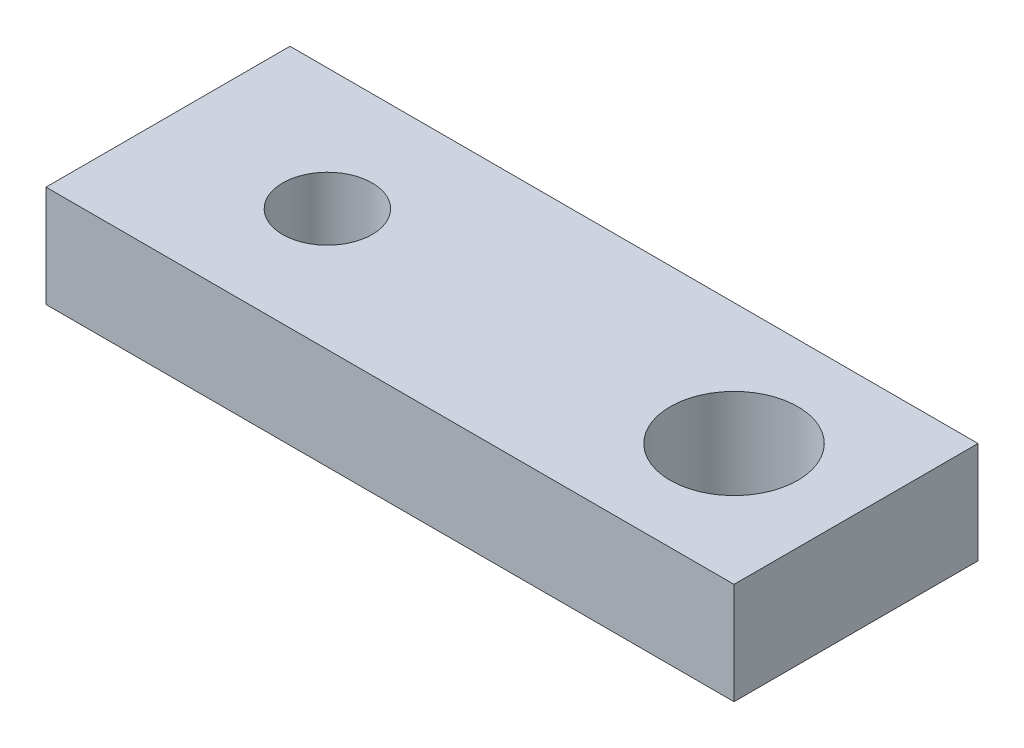
ISO-10303-21;
HEADER;
FILE_DESCRIPTION(('STEP AP214'),'2;1');
FILE_NAME('part.step','',(''),(''),'','','');
FILE_SCHEMA(('AUTOMOTIVE_DESIGN { 1 0 10303 214 1 1 1 1 }'));
ENDSEC;
DATA;
#1=APPLICATION_CONTEXT('core data for automotive mechanical design processes');
#2=APPLICATION_PROTOCOL_DEFINITION('international standard','automotive_design',2000,#1);
#3=PRODUCT_CONTEXT('',#1,'mechanical');
#4=PRODUCT('Part','Part','',(#3));
#5=PRODUCT_RELATED_PRODUCT_CATEGORY('part','',(#4));
#6=PRODUCT_DEFINITION_FORMATION('','',#4);
#7=PRODUCT_DEFINITION_CONTEXT('part definition',#1,'design');
#8=PRODUCT_DEFINITION('design','',#6,#7);
#9=PRODUCT_DEFINITION_SHAPE('','',#8);
#10=(LENGTH_UNIT() NAMED_UNIT(*) SI_UNIT(.MILLI.,.METRE.));
#11=(NAMED_UNIT(*) PLANE_ANGLE_UNIT() SI_UNIT($,.RADIAN.));
#12=(NAMED_UNIT(*) SI_UNIT($,.STERADIAN.) SOLID_ANGLE_UNIT());
#13=UNCERTAINTY_MEASURE_WITH_UNIT(LENGTH_MEASURE(1.E-05),#10,'distance_accuracy_value','');
#14=(GEOMETRIC_REPRESENTATION_CONTEXT(3) GLOBAL_UNCERTAINTY_ASSIGNED_CONTEXT((#13)) GLOBAL_UNIT_ASSIGNED_CONTEXT((#10,
#11,#12)) REPRESENTATION_CONTEXT('',''));
#15=CARTESIAN_POINT('',(0.,0.,0.));
#16=DIRECTION('',(0.,0.,1.));
#17=DIRECTION('',(1.,0.,0.));
#18=AXIS2_PLACEMENT_3D('',#15,#16,#17);
#19=CARTESIAN_POINT('',(0.,3.175,0.));
#20=DIRECTION('',(0.,1.,0.));
#21=DIRECTION('',(0.,0.,1.));
#22=AXIS2_PLACEMENT_3D('',#19,#20,#21);
#23=PLANE('',#22);
#24=CARTESIAN_POINT('',(0.,3.175,0.));
#25=DIRECTION('',(0.,1.,0.));
#26=DIRECTION('',(0.,0.,1.));
#27=AXIS2_PLACEMENT_3D('',#24,#25,#26);
#28=CIRCLE('',#27,1.397);
#29=CARTESIAN_POINT('',(0.,3.175,1.397));
#30=VERTEX_POINT('',#29);
#31=EDGE_CURVE('E100',#30,#30,#28,.T.);
#32=ORIENTED_EDGE('',*,*,#31,.F.);
#33=EDGE_LOOP('',(#32));
#34=FACE_BOUND('',#33,.T.);
#35=DIRECTION('',(0.,0.,1.));
#36=VECTOR('',#35,1.);
#37=CARTESIAN_POINT('',(-4.9784,3.175,-3.81));
#38=LINE('',#37,#36);
#39=CARTESIAN_POINT('',(-4.9784,3.175,-3.81));
#40=VERTEX_POINT('',#39);
#41=CARTESIAN_POINT('',(-4.9784,3.175,3.81));
#42=VERTEX_POINT('',#41);
#43=EDGE_CURVE('E85',#40,#42,#38,.T.);
#44=ORIENTED_EDGE('',*,*,#43,.T.);
#45=DIRECTION('',(1.,0.,0.));
#46=VECTOR('',#45,1.);
#47=CARTESIAN_POINT('',(-4.9784,3.175,3.81));
#48=LINE('',#47,#46);
#49=CARTESIAN_POINT('',(16.51,3.175,3.81));
#50=VERTEX_POINT('',#49);
#51=EDGE_CURVE('E80',#42,#50,#48,.T.);
#52=ORIENTED_EDGE('',*,*,#51,.T.);
#53=DIRECTION('',(0.,0.,-1.));
#54=VECTOR('',#53,1.);
#55=CARTESIAN_POINT('',(16.51,3.175,-3.81));
#56=LINE('',#55,#54);
#57=CARTESIAN_POINT('',(16.51,3.175,-3.81));
#58=VERTEX_POINT('',#57);
#59=EDGE_CURVE('E83',#50,#58,#56,.T.);
#60=ORIENTED_EDGE('',*,*,#59,.T.);
#61=DIRECTION('',(-1.,0.,0.));
#62=VECTOR('',#61,1.);
#63=CARTESIAN_POINT('',(-4.9784,3.175,-3.81));
#64=LINE('',#63,#62);
#65=EDGE_CURVE('E50',#58,#40,#64,.T.);
#66=ORIENTED_EDGE('',*,*,#65,.T.);
#67=EDGE_LOOP('',(#44,#52,#60,#66));
#68=FACE_BOUND('',#67,.T.);
#69=CARTESIAN_POINT('',(12.7,3.175,0.));
#70=DIRECTION('',(0.,1.,0.));
#71=DIRECTION('',(0.,0.,1.));
#72=AXIS2_PLACEMENT_3D('',#69,#70,#71);
#73=CIRCLE('',#72,1.9939);
#74=CARTESIAN_POINT('',(12.7,3.175,1.9939));
#75=VERTEX_POINT('',#74);
#76=EDGE_CURVE('E115',#75,#75,#73,.T.);
#77=ORIENTED_EDGE('',*,*,#76,.F.);
#78=EDGE_LOOP('',(#77));
#79=FACE_BOUND('',#78,.T.);
#80=ADVANCED_FACE('F33',(#34,#68,#79),#23,.T.);
#81=CARTESIAN_POINT('',(0.,0.,0.));
#82=DIRECTION('',(0.,1.,0.));
#83=DIRECTION('',(0.,0.,1.));
#84=AXIS2_PLACEMENT_3D('',#81,#82,#83);
#85=PLANE('',#84);
#86=CARTESIAN_POINT('',(0.,0.,0.));
#87=DIRECTION('',(0.,1.,0.));
#88=DIRECTION('',(0.,0.,1.));
#89=AXIS2_PLACEMENT_3D('',#86,#87,#88);
#90=CIRCLE('',#89,1.397);
#91=CARTESIAN_POINT('',(0.,0.,1.397));
#92=VERTEX_POINT('',#91);
#93=EDGE_CURVE('E112',#92,#92,#90,.T.);
#94=ORIENTED_EDGE('',*,*,#93,.T.);
#95=EDGE_LOOP('',(#94));
#96=FACE_BOUND('',#95,.T.);
#97=DIRECTION('',(0.,0.,1.));
#98=VECTOR('',#97,1.);
#99=CARTESIAN_POINT('',(-4.9784,0.,-3.81));
#100=LINE('',#99,#98);
#101=CARTESIAN_POINT('',(-4.9784,0.,-3.81));
#102=VERTEX_POINT('',#101);
#103=CARTESIAN_POINT('',(-4.9784,0.,3.81));
#104=VERTEX_POINT('',#103);
#105=EDGE_CURVE('E97',#102,#104,#100,.T.);
#106=ORIENTED_EDGE('',*,*,#105,.F.);
#107=DIRECTION('',(-1.,0.,0.));
#108=VECTOR('',#107,1.);
#109=CARTESIAN_POINT('',(-4.9784,0.,-3.81));
#110=LINE('',#109,#108);
#111=CARTESIAN_POINT('',(16.51,0.,-3.81));
#112=VERTEX_POINT('',#111);
#113=EDGE_CURVE('E73',#112,#102,#110,.T.);
#114=ORIENTED_EDGE('',*,*,#113,.F.);
#115=DIRECTION('',(0.,0.,-1.));
#116=VECTOR('',#115,1.);
#117=CARTESIAN_POINT('',(16.51,0.,-3.81));
#118=LINE('',#117,#116);
#119=CARTESIAN_POINT('',(16.51,0.,3.81));
#120=VERTEX_POINT('',#119);
#121=EDGE_CURVE('E67',#120,#112,#118,.T.);
#122=ORIENTED_EDGE('',*,*,#121,.F.);
#123=DIRECTION('',(1.,0.,0.));
#124=VECTOR('',#123,1.);
#125=CARTESIAN_POINT('',(-4.9784,0.,3.81));
#126=LINE('',#125,#124);
#127=EDGE_CURVE('E89',#104,#120,#126,.T.);
#128=ORIENTED_EDGE('',*,*,#127,.F.);
#129=EDGE_LOOP('',(#106,#114,#122,#128));
#130=FACE_BOUND('',#129,.T.);
#131=CARTESIAN_POINT('',(12.7,0.,0.));
#132=DIRECTION('',(0.,1.,0.));
#133=DIRECTION('',(0.,0.,1.));
#134=AXIS2_PLACEMENT_3D('',#131,#132,#133);
#135=CIRCLE('',#134,1.9939);
#136=CARTESIAN_POINT('',(12.7,0.,1.9939));
#137=VERTEX_POINT('',#136);
#138=EDGE_CURVE('E118',#137,#137,#135,.T.);
#139=ORIENTED_EDGE('',*,*,#138,.T.);
#140=EDGE_LOOP('',(#139));
#141=FACE_BOUND('',#140,.T.);
#142=ADVANCED_FACE('F108',(#96,#130,#141),#85,.F.);
#143=CARTESIAN_POINT('',(-4.9784,3.175,-3.81));
#144=DIRECTION('',(1.,0.,0.));
#145=DIRECTION('',(0.,0.,-1.));
#146=AXIS2_PLACEMENT_3D('',#143,#144,#145);
#147=PLANE('',#146);
#148=ORIENTED_EDGE('',*,*,#105,.T.);
#149=DIRECTION('',(0.,-1.,0.));
#150=VECTOR('',#149,1.);
#151=CARTESIAN_POINT('',(-4.9784,3.175,3.81));
#152=LINE('',#151,#150);
#153=EDGE_CURVE('E11',#42,#104,#152,.T.);
#154=ORIENTED_EDGE('',*,*,#153,.F.);
#155=ORIENTED_EDGE('',*,*,#43,.F.);
#156=DIRECTION('',(0.,-1.,0.));
#157=VECTOR('',#156,1.);
#158=CARTESIAN_POINT('',(-4.9784,3.175,-3.81));
#159=LINE('',#158,#157);
#160=EDGE_CURVE('E93',#40,#102,#159,.T.);
#161=ORIENTED_EDGE('',*,*,#160,.T.);
#162=EDGE_LOOP('',(#148,#154,#155,#161));
#163=FACE_BOUND('',#162,.T.);
#164=ADVANCED_FACE('F35',(#163),#147,.F.);
#165=CARTESIAN_POINT('',(-4.9784,3.175,3.81));
#166=DIRECTION('',(0.,0.,-1.));
#167=DIRECTION('',(-1.,0.,0.));
#168=AXIS2_PLACEMENT_3D('',#165,#166,#167);
#169=PLANE('',#168);
#170=ORIENTED_EDGE('',*,*,#127,.T.);
#171=DIRECTION('',(0.,-1.,0.));
#172=VECTOR('',#171,1.);
#173=CARTESIAN_POINT('',(16.51,3.175,3.81));
#174=LINE('',#173,#172);
#175=EDGE_CURVE('E42',#50,#120,#174,.T.);
#176=ORIENTED_EDGE('',*,*,#175,.F.);
#177=ORIENTED_EDGE('',*,*,#51,.F.);
#178=ORIENTED_EDGE('',*,*,#153,.T.);
#179=EDGE_LOOP('',(#170,#176,#177,#178));
#180=FACE_BOUND('',#179,.T.);
#181=ADVANCED_FACE('F88',(#180),#169,.F.);
#182=CARTESIAN_POINT('',(16.51,3.175,-3.81));
#183=DIRECTION('',(-1.,0.,0.));
#184=DIRECTION('',(0.,0.,1.));
#185=AXIS2_PLACEMENT_3D('',#182,#183,#184);
#186=PLANE('',#185);
#187=ORIENTED_EDGE('',*,*,#121,.T.);
#188=DIRECTION('',(0.,-1.,0.));
#189=VECTOR('',#188,1.);
#190=CARTESIAN_POINT('',(16.51,3.175,-3.81));
#191=LINE('',#190,#189);
#192=EDGE_CURVE('E90',#58,#112,#191,.T.);
#193=ORIENTED_EDGE('',*,*,#192,.F.);
#194=ORIENTED_EDGE('',*,*,#59,.F.);
#195=ORIENTED_EDGE('',*,*,#175,.T.);
#196=EDGE_LOOP('',(#187,#193,#194,#195));
#197=FACE_BOUND('',#196,.T.);
#198=ADVANCED_FACE('F91',(#197),#186,.F.);
#199=CARTESIAN_POINT('',(-4.9784,3.175,-3.81));
#200=DIRECTION('',(0.,0.,1.));
#201=DIRECTION('',(1.,0.,0.));
#202=AXIS2_PLACEMENT_3D('',#199,#200,#201);
#203=PLANE('',#202);
#204=ORIENTED_EDGE('',*,*,#113,.T.);
#205=ORIENTED_EDGE('',*,*,#160,.F.);
#206=ORIENTED_EDGE('',*,*,#65,.F.);
#207=ORIENTED_EDGE('',*,*,#192,.T.);
#208=EDGE_LOOP('',(#204,#205,#206,#207));
#209=FACE_BOUND('',#208,.T.);
#210=ADVANCED_FACE('F105',(#209),#203,.F.);
#211=CARTESIAN_POINT('',(0.,3.175,0.));
#212=DIRECTION('',(0.,-1.,0.));
#213=DIRECTION('',(0.,0.,-1.));
#214=AXIS2_PLACEMENT_3D('',#211,#212,#213);
#215=CYLINDRICAL_SURFACE('',#214,1.397);
#216=ORIENTED_EDGE('',*,*,#31,.T.);
#217=EDGE_LOOP('',(#216));
#218=FACE_BOUND('',#217,.T.);
#219=ORIENTED_EDGE('',*,*,#93,.F.);
#220=EDGE_LOOP('',(#219));
#221=FACE_BOUND('',#220,.T.);
#222=ADVANCED_FACE('F136',(#218,#221),#215,.F.);
#223=CARTESIAN_POINT('',(12.7,3.175,0.));
#224=DIRECTION('',(0.,-1.,0.));
#225=DIRECTION('',(0.,0.,-1.));
#226=AXIS2_PLACEMENT_3D('',#223,#224,#225);
#227=CYLINDRICAL_SURFACE('',#226,1.9939);
#228=ORIENTED_EDGE('',*,*,#76,.T.);
#229=EDGE_LOOP('',(#228));
#230=FACE_BOUND('',#229,.T.);
#231=ORIENTED_EDGE('',*,*,#138,.F.);
#232=EDGE_LOOP('',(#231));
#233=FACE_BOUND('',#232,.T.);
#234=ADVANCED_FACE('F124',(#230,#233),#227,.F.);
#235=CLOSED_SHELL('',(#80,#142,#164,#181,#198,#210,#222,#234));
#236=MANIFOLD_SOLID_BREP('B2',#235);
#237=ADVANCED_BREP_SHAPE_REPRESENTATION('',(#18,#236),#14);
#238=SHAPE_DEFINITION_REPRESENTATION(#9,#237);
ENDSEC;
END-ISO-10303-21;
